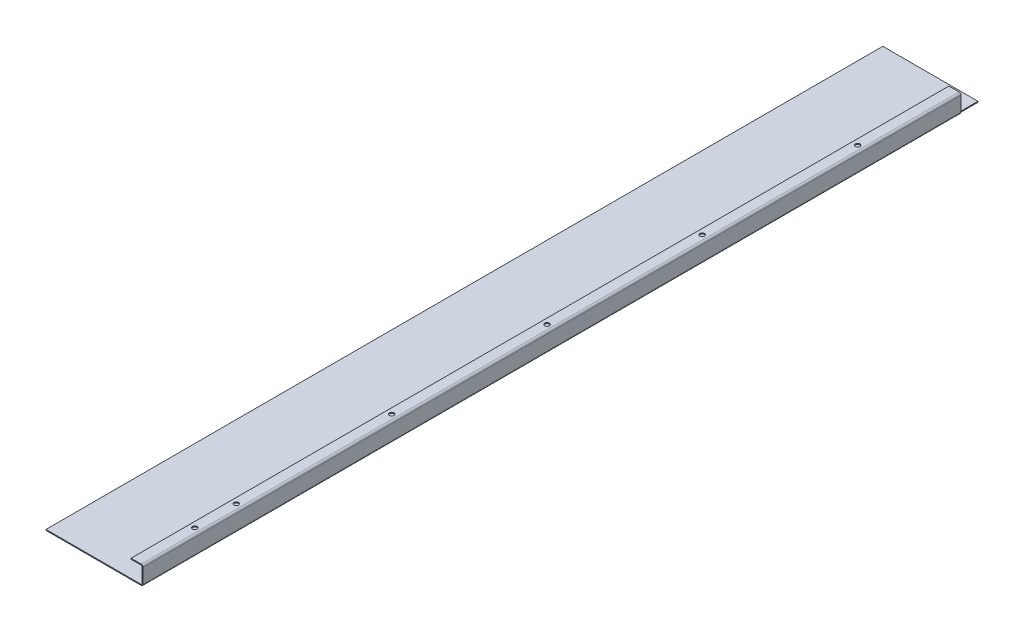
ISO-10303-21;
HEADER;
FILE_DESCRIPTION(('STEP AP214'),'2;1');
FILE_NAME('part.step','',(''),(''),'','','');
FILE_SCHEMA(('AUTOMOTIVE_DESIGN { 1 0 10303 214 1 1 1 1 }'));
ENDSEC;
DATA;
#1=APPLICATION_CONTEXT('core data for automotive mechanical design processes');
#2=APPLICATION_PROTOCOL_DEFINITION('international standard','automotive_design',2000,#1);
#3=PRODUCT_CONTEXT('',#1,'mechanical');
#4=PRODUCT('Part','Part','',(#3));
#5=PRODUCT_RELATED_PRODUCT_CATEGORY('part','',(#4));
#6=PRODUCT_DEFINITION_FORMATION('','',#4);
#7=PRODUCT_DEFINITION_CONTEXT('part definition',#1,'design');
#8=PRODUCT_DEFINITION('design','',#6,#7);
#9=PRODUCT_DEFINITION_SHAPE('','',#8);
#10=(LENGTH_UNIT() NAMED_UNIT(*) SI_UNIT(.MILLI.,.METRE.));
#11=(NAMED_UNIT(*) PLANE_ANGLE_UNIT() SI_UNIT($,.RADIAN.));
#12=(NAMED_UNIT(*) SI_UNIT($,.STERADIAN.) SOLID_ANGLE_UNIT());
#13=UNCERTAINTY_MEASURE_WITH_UNIT(LENGTH_MEASURE(1.E-05),#10,'distance_accuracy_value','');
#14=(GEOMETRIC_REPRESENTATION_CONTEXT(3) GLOBAL_UNCERTAINTY_ASSIGNED_CONTEXT((#13)) GLOBAL_UNIT_ASSIGNED_CONTEXT((#10,
#11,#12)) REPRESENTATION_CONTEXT('',''));
#15=CARTESIAN_POINT('',(0.,0.,0.));
#16=DIRECTION('',(0.,0.,1.));
#17=DIRECTION('',(1.,0.,0.));
#18=AXIS2_PLACEMENT_3D('',#15,#16,#17);
#19=CARTESIAN_POINT('',(105.,-3.86956670765295E-13,0.));
#20=DIRECTION('',(-1.,0.,0.));
#21=DIRECTION('',(0.,-1.,0.));
#22=AXIS2_PLACEMENT_3D('',#19,#20,#21);
#23=PLANE('',#22);
#24=DIRECTION('',(0.,-1.,0.));
#25=VECTOR('',#24,1.);
#26=CARTESIAN_POINT('',(105.,-3.83465189426452E-13,-884.7));
#27=LINE('',#26,#25);
#28=CARTESIAN_POINT('',(105.,17.,-884.7));
#29=VERTEX_POINT('',#28);
#30=CARTESIAN_POINT('',(105.,0.999999999999918,-884.7));
#31=VERTEX_POINT('',#30);
#32=EDGE_CURVE('E351',#29,#31,#27,.T.);
#33=ORIENTED_EDGE('',*,*,#32,.F.);
#34=DIRECTION('',(0.,0.,-1.));
#35=VECTOR('',#34,1.);
#36=CARTESIAN_POINT('',(105.,17.,-905.2));
#37=LINE('',#36,#35);
#38=CARTESIAN_POINT('',(105.,17.,0.));
#39=VERTEX_POINT('',#38);
#40=EDGE_CURVE('E216',#29,#39,#37,.F.);
#41=ORIENTED_EDGE('',*,*,#40,.T.);
#42=DIRECTION('',(0.,-1.,0.));
#43=VECTOR('',#42,1.);
#44=CARTESIAN_POINT('',(105.,-3.86956670765295E-13,0.));
#45=LINE('',#44,#43);
#46=CARTESIAN_POINT('',(105.,0.999999999999969,0.));
#47=VERTEX_POINT('',#46);
#48=EDGE_CURVE('E229',#39,#47,#45,.T.);
#49=ORIENTED_EDGE('',*,*,#48,.T.);
#50=DIRECTION('',(0.,0.,-1.));
#51=VECTOR('',#50,1.);
#52=CARTESIAN_POINT('',(105.,0.999999999999997,0.));
#53=LINE('',#52,#51);
#54=EDGE_CURVE('E235',#31,#47,#53,.F.);
#55=ORIENTED_EDGE('',*,*,#54,.F.);
#56=EDGE_LOOP('',(#33,#41,#49,#55));
#57=FACE_BOUND('',#56,.T.);
#58=ADVANCED_FACE('F78',(#57),#23,.F.);
#59=CARTESIAN_POINT('',(104.,-3.83465189426452E-13,0.));
#60=DIRECTION('',(-1.,0.,0.));
#61=DIRECTION('',(0.,-1.,0.));
#62=AXIS2_PLACEMENT_3D('',#59,#60,#61);
#63=PLANE('',#62);
#64=DIRECTION('',(0.,0.,-1.));
#65=VECTOR('',#64,1.);
#66=CARTESIAN_POINT('',(104.,17.,-905.2));
#67=LINE('',#66,#65);
#68=CARTESIAN_POINT('',(104.,17.,-884.7));
#69=VERTEX_POINT('',#68);
#70=CARTESIAN_POINT('',(104.,17.,0.));
#71=VERTEX_POINT('',#70);
#72=EDGE_CURVE('E223',#69,#71,#67,.F.);
#73=ORIENTED_EDGE('',*,*,#72,.F.);
#74=DIRECTION('',(0.,-1.,0.));
#75=VECTOR('',#74,1.);
#76=CARTESIAN_POINT('',(104.,-3.83304621342186E-13,-884.7));
#77=LINE('',#76,#75);
#78=CARTESIAN_POINT('',(104.,0.999999999999973,-884.7));
#79=VERTEX_POINT('',#78);
#80=EDGE_CURVE('E352',#69,#79,#77,.T.);
#81=ORIENTED_EDGE('',*,*,#80,.T.);
#82=DIRECTION('',(0.,0.,-1.));
#83=VECTOR('',#82,1.);
#84=CARTESIAN_POINT('',(104.,1.,0.));
#85=LINE('',#84,#83);
#86=CARTESIAN_POINT('',(104.,0.999999999999973,0.));
#87=VERTEX_POINT('',#86);
#88=EDGE_CURVE('E237',#87,#79,#85,.T.);
#89=ORIENTED_EDGE('',*,*,#88,.F.);
#90=DIRECTION('',(0.,1.,0.));
#91=VECTOR('',#90,1.);
#92=CARTESIAN_POINT('',(104.,0.,0.));
#93=LINE('',#92,#91);
#94=EDGE_CURVE('E233',#71,#87,#93,.F.);
#95=ORIENTED_EDGE('',*,*,#94,.F.);
#96=EDGE_LOOP('',(#73,#81,#89,#95));
#97=FACE_BOUND('',#96,.T.);
#98=ADVANCED_FACE('F399',(#97),#63,.T.);
#99=CARTESIAN_POINT('',(103.,0.999999999999977,-905.2));
#100=DIRECTION('',(0.,0.,-1.));
#101=DIRECTION('',(1.,0.,0.));
#102=AXIS2_PLACEMENT_3D('',#99,#100,#101);
#103=CYLINDRICAL_SURFACE('',#102,2.00000000000008);
#104=DIRECTION('',(0.,0.,-1.));
#105=VECTOR('',#104,1.);
#106=CARTESIAN_POINT('',(103.,-1.00000000000011,-905.2));
#107=LINE('',#106,#105);
#108=CARTESIAN_POINT('',(103.,-1.00000000000011,-884.7));
#109=VERTEX_POINT('',#108);
#110=CARTESIAN_POINT('',(103.,-1.,0.));
#111=VERTEX_POINT('',#110);
#112=EDGE_CURVE('E103',#109,#111,#107,.F.);
#113=ORIENTED_EDGE('',*,*,#112,.F.);
#114=CARTESIAN_POINT('',(103.,0.999999999999893,-884.7));
#115=DIRECTION('',(0.,0.,1.));
#116=DIRECTION('',(1.,0.,0.));
#117=AXIS2_PLACEMENT_3D('',#114,#115,#116);
#118=CIRCLE('',#117,2.);
#119=EDGE_CURVE('E323',#109,#31,#118,.T.);
#120=ORIENTED_EDGE('',*,*,#119,.T.);
#121=ORIENTED_EDGE('',*,*,#54,.T.);
#122=CARTESIAN_POINT('',(103.,0.999999999999977,0.));
#123=DIRECTION('',(0.,0.,-1.));
#124=DIRECTION('',(-1.,0.,0.));
#125=AXIS2_PLACEMENT_3D('',#122,#123,#124);
#126=CIRCLE('',#125,2.00000000000008);
#127=EDGE_CURVE('E244',#111,#47,#126,.F.);
#128=ORIENTED_EDGE('',*,*,#127,.F.);
#129=EDGE_LOOP('',(#113,#120,#121,#128));
#130=FACE_BOUND('',#129,.T.);
#131=ADVANCED_FACE('F405',(#130),#103,.T.);
#132=CARTESIAN_POINT('',(103.,0.999999999999977,-905.2));
#133=DIRECTION('',(0.,0.,-1.));
#134=DIRECTION('',(1.,0.,0.));
#135=AXIS2_PLACEMENT_3D('',#132,#133,#134);
#136=CYLINDRICAL_SURFACE('',#135,1.00000000000008);
#137=CARTESIAN_POINT('',(103.,0.999999999999893,-884.7));
#138=DIRECTION('',(0.,0.,1.));
#139=DIRECTION('',(1.,0.,0.));
#140=AXIS2_PLACEMENT_3D('',#137,#138,#139);
#141=CIRCLE('',#140,1.);
#142=CARTESIAN_POINT('',(103.,-1.07336015076065E-13,-884.7));
#143=VERTEX_POINT('',#142);
#144=EDGE_CURVE('E329',#143,#79,#141,.T.);
#145=ORIENTED_EDGE('',*,*,#144,.F.);
#146=DIRECTION('',(0.,0.,-1.));
#147=VECTOR('',#146,1.);
#148=CARTESIAN_POINT('',(103.,-1.07336015076065E-13,-905.2));
#149=LINE('',#148,#147);
#150=CARTESIAN_POINT('',(103.,-1.07336015076065E-13,0.));
#151=VERTEX_POINT('',#150);
#152=EDGE_CURVE('E232',#143,#151,#149,.F.);
#153=ORIENTED_EDGE('',*,*,#152,.T.);
#154=CARTESIAN_POINT('',(103.,0.999999999999977,0.));
#155=DIRECTION('',(0.,0.,-1.));
#156=DIRECTION('',(-1.,0.,0.));
#157=AXIS2_PLACEMENT_3D('',#154,#155,#156);
#158=CIRCLE('',#157,1.00000000000008);
#159=EDGE_CURVE('E248',#151,#87,#158,.F.);
#160=ORIENTED_EDGE('',*,*,#159,.T.);
#161=ORIENTED_EDGE('',*,*,#88,.T.);
#162=EDGE_LOOP('',(#145,#153,#160,#161));
#163=FACE_BOUND('',#162,.T.);
#164=ADVANCED_FACE('F420',(#163),#136,.F.);
#165=CARTESIAN_POINT('',(103.,17.,-905.2));
#166=DIRECTION('',(0.,0.,-1.));
#167=DIRECTION('',(0.,1.,0.));
#168=AXIS2_PLACEMENT_3D('',#165,#166,#167);
#169=CYLINDRICAL_SURFACE('',#168,2.);
#170=ORIENTED_EDGE('',*,*,#40,.F.);
#171=CARTESIAN_POINT('',(103.,17.,-884.7));
#172=DIRECTION('',(0.,0.,1.));
#173=DIRECTION('',(1.,0.,0.));
#174=AXIS2_PLACEMENT_3D('',#171,#172,#173);
#175=CIRCLE('',#174,2.);
#176=CARTESIAN_POINT('',(103.,19.0000000000001,-884.7));
#177=VERTEX_POINT('',#176);
#178=EDGE_CURVE('E182',#29,#177,#175,.T.);
#179=ORIENTED_EDGE('',*,*,#178,.T.);
#180=DIRECTION('',(0.,0.,-1.));
#181=VECTOR('',#180,1.);
#182=CARTESIAN_POINT('',(103.,19.,0.));
#183=LINE('',#182,#181);
#184=CARTESIAN_POINT('',(103.,19.,0.));
#185=VERTEX_POINT('',#184);
#186=EDGE_CURVE('E208',#177,#185,#183,.F.);
#187=ORIENTED_EDGE('',*,*,#186,.T.);
#188=CARTESIAN_POINT('',(103.,17.,0.));
#189=DIRECTION('',(0.,0.,-1.));
#190=DIRECTION('',(-1.,0.,0.));
#191=AXIS2_PLACEMENT_3D('',#188,#189,#190);
#192=CIRCLE('',#191,2.);
#193=EDGE_CURVE('E218',#39,#185,#192,.F.);
#194=ORIENTED_EDGE('',*,*,#193,.F.);
#195=EDGE_LOOP('',(#170,#179,#187,#194));
#196=FACE_BOUND('',#195,.T.);
#197=ADVANCED_FACE('F424',(#196),#169,.T.);
#198=CARTESIAN_POINT('',(103.,17.,-905.2));
#199=DIRECTION('',(0.,0.,-1.));
#200=DIRECTION('',(0.,1.,0.));
#201=AXIS2_PLACEMENT_3D('',#198,#199,#200);
#202=CYLINDRICAL_SURFACE('',#201,1.);
#203=CARTESIAN_POINT('',(103.,17.,-884.7));
#204=DIRECTION('',(0.,0.,1.));
#205=DIRECTION('',(1.,0.,0.));
#206=AXIS2_PLACEMENT_3D('',#203,#204,#205);
#207=CIRCLE('',#206,1.);
#208=CARTESIAN_POINT('',(103.,18.,-884.7));
#209=VERTEX_POINT('',#208);
#210=EDGE_CURVE('E183',#69,#209,#207,.T.);
#211=ORIENTED_EDGE('',*,*,#210,.F.);
#212=ORIENTED_EDGE('',*,*,#72,.T.);
#213=CARTESIAN_POINT('',(103.,17.,0.));
#214=DIRECTION('',(0.,0.,-1.));
#215=DIRECTION('',(-1.,0.,0.));
#216=AXIS2_PLACEMENT_3D('',#213,#214,#215);
#217=CIRCLE('',#216,1.);
#218=CARTESIAN_POINT('',(103.,18.,0.));
#219=VERTEX_POINT('',#218);
#220=EDGE_CURVE('E207',#71,#219,#217,.F.);
#221=ORIENTED_EDGE('',*,*,#220,.T.);
#222=DIRECTION('',(0.,0.,-1.));
#223=VECTOR('',#222,1.);
#224=CARTESIAN_POINT('',(103.,18.,0.));
#225=LINE('',#224,#223);
#226=EDGE_CURVE('E199',#219,#209,#225,.T.);
#227=ORIENTED_EDGE('',*,*,#226,.T.);
#228=EDGE_LOOP('',(#211,#212,#221,#227));
#229=FACE_BOUND('',#228,.T.);
#230=ADVANCED_FACE('F205',(#229),#202,.F.);
#231=CARTESIAN_POINT('',(1.40823756520346E-13,19.0000000000008,0.));
#232=DIRECTION('',(0.,-1.,0.));
#233=DIRECTION('',(1.,0.,0.));
#234=AXIS2_PLACEMENT_3D('',#231,#232,#233);
#235=PLANE('',#234);
#236=CARTESIAN_POINT('',(97.9999999999785,19.,-780.));
#237=DIRECTION('',(0.,1.,0.));
#238=DIRECTION('',(-1.,0.,0.));
#239=AXIS2_PLACEMENT_3D('',#236,#237,#238);
#240=CIRCLE('',#239,2.5);
#241=CARTESIAN_POINT('',(95.4999999999785,19.0000000000001,-780.));
#242=VERTEX_POINT('',#241);
#243=EDGE_CURVE('E320',#242,#242,#240,.T.);
#244=ORIENTED_EDGE('',*,*,#243,.F.);
#245=EDGE_LOOP('',(#244));
#246=FACE_BOUND('',#245,.T.);
#247=CARTESIAN_POINT('',(97.9999999999838,19.,-612.));
#248=DIRECTION('',(0.,1.,0.));
#249=DIRECTION('',(-1.,0.,0.));
#250=AXIS2_PLACEMENT_3D('',#247,#248,#249);
#251=CIRCLE('',#250,2.5);
#252=CARTESIAN_POINT('',(95.4999999999838,19.0000000000001,-612.));
#253=VERTEX_POINT('',#252);
#254=EDGE_CURVE('E322',#253,#253,#251,.T.);
#255=ORIENTED_EDGE('',*,*,#254,.F.);
#256=EDGE_LOOP('',(#255));
#257=FACE_BOUND('',#256,.T.);
#258=CARTESIAN_POINT('',(97.9999999999892,19.,-444.));
#259=DIRECTION('',(0.,1.,0.));
#260=DIRECTION('',(-1.,0.,0.));
#261=AXIS2_PLACEMENT_3D('',#258,#259,#260);
#262=CIRCLE('',#261,2.5);
#263=CARTESIAN_POINT('',(95.4999999999892,19.0000000000001,-444.));
#264=VERTEX_POINT('',#263);
#265=EDGE_CURVE('E326',#264,#264,#262,.T.);
#266=ORIENTED_EDGE('',*,*,#265,.F.);
#267=EDGE_LOOP('',(#266));
#268=FACE_BOUND('',#267,.T.);
#269=CARTESIAN_POINT('',(97.9999999999945,19.,-276.));
#270=DIRECTION('',(0.,1.,0.));
#271=DIRECTION('',(-1.,0.,0.));
#272=AXIS2_PLACEMENT_3D('',#269,#270,#271);
#273=CIRCLE('',#272,2.50000000000001);
#274=CARTESIAN_POINT('',(95.4999999999945,19.0000000000001,-276.));
#275=VERTEX_POINT('',#274);
#276=EDGE_CURVE('E370',#275,#275,#273,.T.);
#277=ORIENTED_EDGE('',*,*,#276,.F.);
#278=EDGE_LOOP('',(#277));
#279=FACE_BOUND('',#278,.T.);
#280=CARTESIAN_POINT('',(97.9999999999999,19.,-108.));
#281=DIRECTION('',(0.,1.,0.));
#282=DIRECTION('',(-1.,0.,0.));
#283=AXIS2_PLACEMENT_3D('',#280,#281,#282);
#284=CIRCLE('',#283,2.50000000000001);
#285=CARTESIAN_POINT('',(95.4999999999999,19.0000000000001,-108.));
#286=VERTEX_POINT('',#285);
#287=EDGE_CURVE('E367',#286,#286,#284,.T.);
#288=ORIENTED_EDGE('',*,*,#287,.F.);
#289=EDGE_LOOP('',(#288));
#290=FACE_BOUND('',#289,.T.);
#291=CARTESIAN_POINT('',(97.9999999999999,19.,-63.));
#292=DIRECTION('',(0.,1.,0.));
#293=DIRECTION('',(-1.,0.,0.));
#294=AXIS2_PLACEMENT_3D('',#291,#292,#293);
#295=CIRCLE('',#294,2.5);
#296=CARTESIAN_POINT('',(95.4999999999999,19.0000000000001,-63.));
#297=VERTEX_POINT('',#296);
#298=EDGE_CURVE('E280',#297,#297,#295,.T.);
#299=ORIENTED_EDGE('',*,*,#298,.F.);
#300=EDGE_LOOP('',(#299));
#301=FACE_BOUND('',#300,.T.);
#302=DIRECTION('',(1.,0.,0.));
#303=VECTOR('',#302,1.);
#304=CARTESIAN_POINT('',(-3.19189119579733E-13,19.0000000000003,-884.7));
#305=LINE('',#304,#303);
#306=CARTESIAN_POINT('',(91.9999999999999,19.0000000000001,-884.7));
#307=VERTEX_POINT('',#306);
#308=EDGE_CURVE('E179',#307,#177,#305,.T.);
#309=ORIENTED_EDGE('',*,*,#308,.F.);
#310=DIRECTION('',(0.,0.,1.));
#311=VECTOR('',#310,1.);
#312=CARTESIAN_POINT('',(92.0000000000001,19.0000000000001,0.));
#313=LINE('',#312,#311);
#314=CARTESIAN_POINT('',(92.0000000000001,19.0000000000001,0.));
#315=VERTEX_POINT('',#314);
#316=EDGE_CURVE('E338',#307,#315,#313,.T.);
#317=ORIENTED_EDGE('',*,*,#316,.T.);
#318=DIRECTION('',(1.,0.,0.));
#319=VECTOR('',#318,1.);
#320=CARTESIAN_POINT('',(1.40823756520346E-13,19.0000000000008,0.));
#321=LINE('',#320,#319);
#322=EDGE_CURVE('E335',#315,#185,#321,.T.);
#323=ORIENTED_EDGE('',*,*,#322,.T.);
#324=ORIENTED_EDGE('',*,*,#186,.F.);
#325=EDGE_LOOP('',(#309,#317,#323,#324));
#326=FACE_BOUND('',#325,.T.);
#327=ADVANCED_FACE('F301',(#246,#257,#268,#279,#290,#301,#326),#235,.F.);
#328=CARTESIAN_POINT('',(1.33680225758394E-13,18.0000000000008,0.));
#329=DIRECTION('',(0.,-1.,0.));
#330=DIRECTION('',(1.,0.,0.));
#331=AXIS2_PLACEMENT_3D('',#328,#329,#330);
#332=PLANE('',#331);
#333=CARTESIAN_POINT('',(97.9999999999999,18.,-63.));
#334=DIRECTION('',(0.,-1.,0.));
#335=DIRECTION('',(1.,0.,0.));
#336=AXIS2_PLACEMENT_3D('',#333,#334,#335);
#337=CIRCLE('',#336,2.5);
#338=CARTESIAN_POINT('',(100.5,18.,-63.));
#339=VERTEX_POINT('',#338);
#340=EDGE_CURVE('E82',#339,#339,#337,.T.);
#341=ORIENTED_EDGE('',*,*,#340,.F.);
#342=EDGE_LOOP('',(#341));
#343=FACE_BOUND('',#342,.T.);
#344=CARTESIAN_POINT('',(97.9999999999999,18.,-108.));
#345=DIRECTION('',(0.,-1.,0.));
#346=DIRECTION('',(1.,0.,0.));
#347=AXIS2_PLACEMENT_3D('',#344,#345,#346);
#348=CIRCLE('',#347,2.50000000000001);
#349=CARTESIAN_POINT('',(100.5,18.,-108.));
#350=VERTEX_POINT('',#349);
#351=EDGE_CURVE('E288',#350,#350,#348,.T.);
#352=ORIENTED_EDGE('',*,*,#351,.F.);
#353=EDGE_LOOP('',(#352));
#354=FACE_BOUND('',#353,.T.);
#355=CARTESIAN_POINT('',(97.9999999999945,18.,-276.));
#356=DIRECTION('',(0.,-1.,0.));
#357=DIRECTION('',(1.,0.,0.));
#358=AXIS2_PLACEMENT_3D('',#355,#356,#357);
#359=CIRCLE('',#358,2.50000000000001);
#360=CARTESIAN_POINT('',(100.499999999995,18.,-276.));
#361=VERTEX_POINT('',#360);
#362=EDGE_CURVE('E286',#361,#361,#359,.T.);
#363=ORIENTED_EDGE('',*,*,#362,.F.);
#364=EDGE_LOOP('',(#363));
#365=FACE_BOUND('',#364,.T.);
#366=CARTESIAN_POINT('',(97.9999999999892,18.,-444.));
#367=DIRECTION('',(0.,-1.,0.));
#368=DIRECTION('',(1.,0.,0.));
#369=AXIS2_PLACEMENT_3D('',#366,#367,#368);
#370=CIRCLE('',#369,2.5);
#371=CARTESIAN_POINT('',(100.499999999989,18.,-444.));
#372=VERTEX_POINT('',#371);
#373=EDGE_CURVE('E283',#372,#372,#370,.T.);
#374=ORIENTED_EDGE('',*,*,#373,.F.);
#375=EDGE_LOOP('',(#374));
#376=FACE_BOUND('',#375,.T.);
#377=CARTESIAN_POINT('',(97.9999999999838,18.,-612.));
#378=DIRECTION('',(0.,-1.,0.));
#379=DIRECTION('',(1.,0.,0.));
#380=AXIS2_PLACEMENT_3D('',#377,#378,#379);
#381=CIRCLE('',#380,2.5);
#382=CARTESIAN_POINT('',(100.499999999984,18.,-612.));
#383=VERTEX_POINT('',#382);
#384=EDGE_CURVE('E279',#383,#383,#381,.T.);
#385=ORIENTED_EDGE('',*,*,#384,.F.);
#386=EDGE_LOOP('',(#385));
#387=FACE_BOUND('',#386,.T.);
#388=CARTESIAN_POINT('',(97.9999999999785,18.,-780.));
#389=DIRECTION('',(0.,-1.,0.));
#390=DIRECTION('',(1.,0.,0.));
#391=AXIS2_PLACEMENT_3D('',#388,#389,#390);
#392=CIRCLE('',#391,2.5);
#393=CARTESIAN_POINT('',(100.499999999978,18.,-780.));
#394=VERTEX_POINT('',#393);
#395=EDGE_CURVE('E276',#394,#394,#392,.T.);
#396=ORIENTED_EDGE('',*,*,#395,.F.);
#397=EDGE_LOOP('',(#396));
#398=FACE_BOUND('',#397,.T.);
#399=DIRECTION('',(0.,0.,-1.));
#400=VECTOR('',#399,1.);
#401=CARTESIAN_POINT('',(92.0000000000001,18.0000000000001,0.));
#402=LINE('',#401,#400);
#403=CARTESIAN_POINT('',(91.9999999999999,18.0000000000001,-884.7));
#404=VERTEX_POINT('',#403);
#405=CARTESIAN_POINT('',(92.0000000000001,18.0000000000001,0.));
#406=VERTEX_POINT('',#405);
#407=EDGE_CURVE('E201',#404,#406,#402,.F.);
#408=ORIENTED_EDGE('',*,*,#407,.F.);
#409=DIRECTION('',(1.,0.,0.));
#410=VECTOR('',#409,1.);
#411=CARTESIAN_POINT('',(1.33595742037109E-13,18.0000000000008,-884.7));
#412=LINE('',#411,#410);
#413=EDGE_CURVE('E95',#404,#209,#412,.T.);
#414=ORIENTED_EDGE('',*,*,#413,.T.);
#415=ORIENTED_EDGE('',*,*,#226,.F.);
#416=DIRECTION('',(-1.,0.,0.));
#417=VECTOR('',#416,1.);
#418=CARTESIAN_POINT('',(104.,18.,0.));
#419=LINE('',#418,#417);
#420=EDGE_CURVE('E340',#406,#219,#419,.F.);
#421=ORIENTED_EDGE('',*,*,#420,.F.);
#422=EDGE_LOOP('',(#408,#414,#415,#421));
#423=FACE_BOUND('',#422,.T.);
#424=ADVANCED_FACE('F197',(#343,#354,#365,#376,#387,#398,#423),#332,.T.);
#425=CARTESIAN_POINT('',(92.0000000000001,19.0000000000001,0.));
#426=DIRECTION('',(1.,0.,0.));
#427=DIRECTION('',(0.,1.,0.));
#428=AXIS2_PLACEMENT_3D('',#425,#426,#427);
#429=PLANE('',#428);
#430=DIRECTION('',(0.,1.,0.));
#431=VECTOR('',#430,1.);
#432=CARTESIAN_POINT('',(91.9999999999999,19.0000000000001,-884.7));
#433=LINE('',#432,#431);
#434=EDGE_CURVE('E202',#307,#404,#433,.F.);
#435=ORIENTED_EDGE('',*,*,#434,.T.);
#436=ORIENTED_EDGE('',*,*,#407,.T.);
#437=DIRECTION('',(0.,-1.,0.));
#438=VECTOR('',#437,1.);
#439=CARTESIAN_POINT('',(92.0000000000001,19.0000000000001,0.));
#440=LINE('',#439,#438);
#441=EDGE_CURVE('E225',#315,#406,#440,.T.);
#442=ORIENTED_EDGE('',*,*,#441,.F.);
#443=ORIENTED_EDGE('',*,*,#316,.F.);
#444=EDGE_LOOP('',(#435,#436,#442,#443));
#445=FACE_BOUND('',#444,.T.);
#446=ADVANCED_FACE('F300',(#445),#429,.F.);
#447=CARTESIAN_POINT('',(105.,0.,0.));
#448=DIRECTION('',(0.,0.,-1.));
#449=DIRECTION('',(0.,1.,0.));
#450=AXIS2_PLACEMENT_3D('',#447,#448,#449);
#451=PLANE('',#450);
#452=DIRECTION('',(1.,0.,0.));
#453=VECTOR('',#452,1.);
#454=CARTESIAN_POINT('',(104.,17.,0.));
#455=LINE('',#454,#453);
#456=EDGE_CURVE('E221',#71,#39,#455,.T.);
#457=ORIENTED_EDGE('',*,*,#456,.F.);
#458=ORIENTED_EDGE('',*,*,#94,.T.);
#459=DIRECTION('',(-1.,0.,0.));
#460=VECTOR('',#459,1.);
#461=CARTESIAN_POINT('',(105.,0.999999999999997,0.));
#462=LINE('',#461,#460);
#463=EDGE_CURVE('E228',#87,#47,#462,.F.);
#464=ORIENTED_EDGE('',*,*,#463,.T.);
#465=ORIENTED_EDGE('',*,*,#48,.F.);
#466=EDGE_LOOP('',(#457,#458,#464,#465));
#467=FACE_BOUND('',#466,.T.);
#468=ADVANCED_FACE('F413',(#467),#451,.F.);
#469=CARTESIAN_POINT('',(-1.66533453693773E-13,-1.,-905.2));
#470=DIRECTION('',(0.,0.,-1.));
#471=DIRECTION('',(-1.,0.,0.));
#472=AXIS2_PLACEMENT_3D('',#469,#470,#471);
#473=PLANE('',#472);
#474=DIRECTION('',(-1.,0.,0.));
#475=VECTOR('',#474,1.);
#476=CARTESIAN_POINT('',(-1.66533453693773E-13,0.,-905.2));
#477=LINE('',#476,#475);
#478=CARTESIAN_POINT('',(103.,-1.07336015076065E-13,-905.2));
#479=VERTEX_POINT('',#478);
#480=CARTESIAN_POINT('',(-1.66533453693773E-13,0.,-905.2));
#481=VERTEX_POINT('',#480);
#482=EDGE_CURVE('E264',#479,#481,#477,.T.);
#483=ORIENTED_EDGE('',*,*,#482,.F.);
#484=DIRECTION('',(0.,-1.,0.));
#485=VECTOR('',#484,1.);
#486=CARTESIAN_POINT('',(103.,-1.07336015076065E-13,-905.2));
#487=LINE('',#486,#485);
#488=CARTESIAN_POINT('',(103.,-1.00000000000011,-905.2));
#489=VERTEX_POINT('',#488);
#490=EDGE_CURVE('E247',#479,#489,#487,.T.);
#491=ORIENTED_EDGE('',*,*,#490,.T.);
#492=DIRECTION('',(-1.,0.,0.));
#493=VECTOR('',#492,1.);
#494=CARTESIAN_POINT('',(-1.66533453693773E-13,-1.,-905.2));
#495=LINE('',#494,#493);
#496=CARTESIAN_POINT('',(-1.66533453693773E-13,-1.,-905.2));
#497=VERTEX_POINT('',#496);
#498=EDGE_CURVE('E267',#489,#497,#495,.T.);
#499=ORIENTED_EDGE('',*,*,#498,.T.);
#500=DIRECTION('',(0.,1.,0.));
#501=VECTOR('',#500,1.);
#502=CARTESIAN_POINT('',(-1.66533453693773E-13,-1.,-905.2));
#503=LINE('',#502,#501);
#504=EDGE_CURVE('E13',#497,#481,#503,.T.);
#505=ORIENTED_EDGE('',*,*,#504,.T.);
#506=EDGE_LOOP('',(#483,#491,#499,#505));
#507=FACE_BOUND('',#506,.T.);
#508=ADVANCED_FACE('F416',(#507),#473,.T.);
#509=CARTESIAN_POINT('',(0.,-1.,0.));
#510=DIRECTION('',(0.,-1.,0.));
#511=DIRECTION('',(0.,0.,-1.));
#512=AXIS2_PLACEMENT_3D('',#509,#510,#511);
#513=PLANE('',#512);
#514=ORIENTED_EDGE('',*,*,#498,.F.);
#515=EDGE_CURVE('E242',#489,#109,#107,.F.);
#516=ORIENTED_EDGE('',*,*,#515,.T.);
#517=ORIENTED_EDGE('',*,*,#112,.T.);
#518=DIRECTION('',(1.,0.,0.));
#519=VECTOR('',#518,1.);
#520=CARTESIAN_POINT('',(0.,-1.,0.));
#521=LINE('',#520,#519);
#522=CARTESIAN_POINT('',(0.,-1.,0.));
#523=VERTEX_POINT('',#522);
#524=EDGE_CURVE('E263',#523,#111,#521,.T.);
#525=ORIENTED_EDGE('',*,*,#524,.F.);
#526=DIRECTION('',(0.,0.,1.));
#527=VECTOR('',#526,1.);
#528=CARTESIAN_POINT('',(0.,-1.,0.));
#529=LINE('',#528,#527);
#530=EDGE_CURVE('E260',#497,#523,#529,.T.);
#531=ORIENTED_EDGE('',*,*,#530,.F.);
#532=EDGE_LOOP('',(#514,#516,#517,#525,#531));
#533=FACE_BOUND('',#532,.T.);
#534=ADVANCED_FACE('F431',(#533),#513,.T.);
#535=CARTESIAN_POINT('',(0.,0.,0.));
#536=DIRECTION('',(0.,-1.,0.));
#537=DIRECTION('',(0.,0.,-1.));
#538=AXIS2_PLACEMENT_3D('',#535,#536,#537);
#539=PLANE('',#538);
#540=EDGE_CURVE('E251',#479,#143,#149,.F.);
#541=ORIENTED_EDGE('',*,*,#540,.F.);
#542=ORIENTED_EDGE('',*,*,#482,.T.);
#543=DIRECTION('',(0.,0.,1.));
#544=VECTOR('',#543,1.);
#545=CARTESIAN_POINT('',(0.,0.,0.));
#546=LINE('',#545,#544);
#547=CARTESIAN_POINT('',(0.,0.,0.));
#548=VERTEX_POINT('',#547);
#549=EDGE_CURVE('E257',#481,#548,#546,.T.);
#550=ORIENTED_EDGE('',*,*,#549,.T.);
#551=DIRECTION('',(1.,0.,0.));
#552=VECTOR('',#551,1.);
#553=CARTESIAN_POINT('',(0.,0.,0.));
#554=LINE('',#553,#552);
#555=EDGE_CURVE('E271',#548,#151,#554,.T.);
#556=ORIENTED_EDGE('',*,*,#555,.T.);
#557=ORIENTED_EDGE('',*,*,#152,.F.);
#558=EDGE_LOOP('',(#541,#542,#550,#556,#557));
#559=FACE_BOUND('',#558,.T.);
#560=ADVANCED_FACE('F434',(#559),#539,.F.);
#561=CARTESIAN_POINT('',(0.,-1.,0.));
#562=DIRECTION('',(-1.,0.,0.));
#563=DIRECTION('',(0.,0.,1.));
#564=AXIS2_PLACEMENT_3D('',#561,#562,#563);
#565=PLANE('',#564);
#566=ORIENTED_EDGE('',*,*,#549,.F.);
#567=ORIENTED_EDGE('',*,*,#504,.F.);
#568=ORIENTED_EDGE('',*,*,#530,.T.);
#569=DIRECTION('',(0.,1.,0.));
#570=VECTOR('',#569,1.);
#571=CARTESIAN_POINT('',(0.,-1.,0.));
#572=LINE('',#571,#570);
#573=EDGE_CURVE('E87',#523,#548,#572,.T.);
#574=ORIENTED_EDGE('',*,*,#573,.T.);
#575=EDGE_LOOP('',(#566,#567,#568,#574));
#576=FACE_BOUND('',#575,.T.);
#577=ADVANCED_FACE('F80',(#576),#565,.T.);
#578=CARTESIAN_POINT('',(0.,-1.,0.));
#579=DIRECTION('',(0.,0.,1.));
#580=DIRECTION('',(1.,0.,0.));
#581=AXIS2_PLACEMENT_3D('',#578,#579,#580);
#582=PLANE('',#581);
#583=DIRECTION('',(0.,-1.,0.));
#584=VECTOR('',#583,1.);
#585=CARTESIAN_POINT('',(103.,-1.07336015076065E-13,0.));
#586=LINE('',#585,#584);
#587=EDGE_CURVE('E254',#151,#111,#586,.T.);
#588=ORIENTED_EDGE('',*,*,#587,.F.);
#589=ORIENTED_EDGE('',*,*,#555,.F.);
#590=ORIENTED_EDGE('',*,*,#573,.F.);
#591=ORIENTED_EDGE('',*,*,#524,.T.);
#592=EDGE_LOOP('',(#588,#589,#590,#591));
#593=FACE_BOUND('',#592,.T.);
#594=ADVANCED_FACE('F429',(#593),#582,.T.);
#595=CARTESIAN_POINT('',(103.,0.999999999999977,0.));
#596=DIRECTION('',(0.,0.,1.));
#597=DIRECTION('',(1.,0.,0.));
#598=AXIS2_PLACEMENT_3D('',#595,#596,#597);
#599=PLANE('',#598);
#600=ORIENTED_EDGE('',*,*,#463,.F.);
#601=ORIENTED_EDGE('',*,*,#159,.F.);
#602=ORIENTED_EDGE('',*,*,#587,.T.);
#603=ORIENTED_EDGE('',*,*,#127,.T.);
#604=EDGE_LOOP('',(#600,#601,#602,#603));
#605=FACE_BOUND('',#604,.T.);
#606=ADVANCED_FACE('F426',(#605),#599,.T.);
#607=CARTESIAN_POINT('',(103.,17.,0.));
#608=DIRECTION('',(0.,0.,1.));
#609=DIRECTION('',(1.,0.,0.));
#610=AXIS2_PLACEMENT_3D('',#607,#608,#609);
#611=PLANE('',#610);
#612=DIRECTION('',(0.,-1.,0.));
#613=VECTOR('',#612,1.);
#614=CARTESIAN_POINT('',(103.,19.,0.));
#615=LINE('',#614,#613);
#616=EDGE_CURVE('E209',#219,#185,#615,.F.);
#617=ORIENTED_EDGE('',*,*,#616,.F.);
#618=ORIENTED_EDGE('',*,*,#220,.F.);
#619=ORIENTED_EDGE('',*,*,#456,.T.);
#620=ORIENTED_EDGE('',*,*,#193,.T.);
#621=EDGE_LOOP('',(#617,#618,#619,#620));
#622=FACE_BOUND('',#621,.T.);
#623=ADVANCED_FACE('F410',(#622),#611,.T.);
#624=CARTESIAN_POINT('',(104.,19.,0.));
#625=DIRECTION('',(0.,0.,-1.));
#626=DIRECTION('',(-1.,0.,0.));
#627=AXIS2_PLACEMENT_3D('',#624,#625,#626);
#628=PLANE('',#627);
#629=ORIENTED_EDGE('',*,*,#616,.T.);
#630=ORIENTED_EDGE('',*,*,#322,.F.);
#631=ORIENTED_EDGE('',*,*,#441,.T.);
#632=ORIENTED_EDGE('',*,*,#420,.T.);
#633=EDGE_LOOP('',(#629,#630,#631,#632));
#634=FACE_BOUND('',#633,.T.);
#635=ADVANCED_FACE('F316',(#634),#628,.F.);
#636=CARTESIAN_POINT('',(97.9999999999784,9.00000000000004,-780.));
#637=DIRECTION('',(0.,1.,0.));
#638=DIRECTION('',(-1.,0.,0.));
#639=AXIS2_PLACEMENT_3D('',#636,#637,#638);
#640=CYLINDRICAL_SURFACE('',#639,2.5);
#641=ORIENTED_EDGE('',*,*,#395,.T.);
#642=EDGE_LOOP('',(#641));
#643=FACE_BOUND('',#642,.T.);
#644=ORIENTED_EDGE('',*,*,#243,.T.);
#645=EDGE_LOOP('',(#644));
#646=FACE_BOUND('',#645,.T.);
#647=ADVANCED_FACE('F312',(#643,#646),#640,.F.);
#648=CARTESIAN_POINT('',(97.9999999999838,9.00000000000004,-612.));
#649=DIRECTION('',(0.,1.,0.));
#650=DIRECTION('',(-1.,0.,0.));
#651=AXIS2_PLACEMENT_3D('',#648,#649,#650);
#652=CYLINDRICAL_SURFACE('',#651,2.5);
#653=ORIENTED_EDGE('',*,*,#384,.T.);
#654=EDGE_LOOP('',(#653));
#655=FACE_BOUND('',#654,.T.);
#656=ORIENTED_EDGE('',*,*,#254,.T.);
#657=EDGE_LOOP('',(#656));
#658=FACE_BOUND('',#657,.T.);
#659=ADVANCED_FACE('F315',(#655,#658),#652,.F.);
#660=CARTESIAN_POINT('',(97.9999999999891,9.00000000000004,-444.));
#661=DIRECTION('',(0.,1.,0.));
#662=DIRECTION('',(-1.,0.,0.));
#663=AXIS2_PLACEMENT_3D('',#660,#661,#662);
#664=CYLINDRICAL_SURFACE('',#663,2.5);
#665=ORIENTED_EDGE('',*,*,#373,.T.);
#666=EDGE_LOOP('',(#665));
#667=FACE_BOUND('',#666,.T.);
#668=ORIENTED_EDGE('',*,*,#265,.T.);
#669=EDGE_LOOP('',(#668));
#670=FACE_BOUND('',#669,.T.);
#671=ADVANCED_FACE('F375',(#667,#670),#664,.F.);
#672=CARTESIAN_POINT('',(97.9999999999945,9.00000000000004,-276.));
#673=DIRECTION('',(0.,1.,0.));
#674=DIRECTION('',(-1.,0.,0.));
#675=AXIS2_PLACEMENT_3D('',#672,#673,#674);
#676=CYLINDRICAL_SURFACE('',#675,2.50000000000001);
#677=ORIENTED_EDGE('',*,*,#362,.T.);
#678=EDGE_LOOP('',(#677));
#679=FACE_BOUND('',#678,.T.);
#680=ORIENTED_EDGE('',*,*,#276,.T.);
#681=EDGE_LOOP('',(#680));
#682=FACE_BOUND('',#681,.T.);
#683=ADVANCED_FACE('F396',(#679,#682),#676,.F.);
#684=CARTESIAN_POINT('',(97.9999999999998,9.00000000000004,-108.));
#685=DIRECTION('',(0.,1.,0.));
#686=DIRECTION('',(-1.,0.,0.));
#687=AXIS2_PLACEMENT_3D('',#684,#685,#686);
#688=CYLINDRICAL_SURFACE('',#687,2.50000000000001);
#689=ORIENTED_EDGE('',*,*,#351,.T.);
#690=EDGE_LOOP('',(#689));
#691=FACE_BOUND('',#690,.T.);
#692=ORIENTED_EDGE('',*,*,#287,.T.);
#693=EDGE_LOOP('',(#692));
#694=FACE_BOUND('',#693,.T.);
#695=ADVANCED_FACE('F387',(#691,#694),#688,.F.);
#696=CARTESIAN_POINT('',(97.9999999999999,9.00000000000004,-63.));
#697=DIRECTION('',(0.,1.,0.));
#698=DIRECTION('',(-1.,0.,0.));
#699=AXIS2_PLACEMENT_3D('',#696,#697,#698);
#700=CYLINDRICAL_SURFACE('',#699,2.5);
#701=ORIENTED_EDGE('',*,*,#340,.T.);
#702=EDGE_LOOP('',(#701));
#703=FACE_BOUND('',#702,.T.);
#704=ORIENTED_EDGE('',*,*,#298,.T.);
#705=EDGE_LOOP('',(#704));
#706=FACE_BOUND('',#705,.T.);
#707=ADVANCED_FACE('F295',(#703,#706),#700,.F.);
#708=CARTESIAN_POINT('',(103.,0.999999999999893,-884.7));
#709=DIRECTION('',(0.,0.,-1.));
#710=DIRECTION('',(-1.,0.,0.));
#711=AXIS2_PLACEMENT_3D('',#708,#709,#710);
#712=PLANE('',#711);
#713=DIRECTION('',(0.,-1.,0.));
#714=VECTOR('',#713,1.);
#715=CARTESIAN_POINT('',(103.,-3.76161090580234E-13,-884.7));
#716=LINE('',#715,#714);
#717=EDGE_CURVE('E361',#143,#109,#716,.T.);
#718=ORIENTED_EDGE('',*,*,#717,.F.);
#719=ORIENTED_EDGE('',*,*,#144,.T.);
#720=DIRECTION('',(-1.,0.,0.));
#721=VECTOR('',#720,1.);
#722=CARTESIAN_POINT('',(105.,0.999999999999918,-884.7));
#723=LINE('',#722,#721);
#724=EDGE_CURVE('E359',#31,#79,#723,.T.);
#725=ORIENTED_EDGE('',*,*,#724,.F.);
#726=ORIENTED_EDGE('',*,*,#119,.F.);
#727=EDGE_LOOP('',(#718,#719,#725,#726));
#728=FACE_BOUND('',#727,.T.);
#729=ADVANCED_FACE('F386',(#728),#712,.T.);
#730=CARTESIAN_POINT('',(103.,-1.07336015076065E-13,-894.95));
#731=DIRECTION('',(-1.,0.,0.));
#732=DIRECTION('',(0.,0.,-1.));
#733=AXIS2_PLACEMENT_3D('',#730,#731,#732);
#734=PLANE('',#733);
#735=ORIENTED_EDGE('',*,*,#490,.F.);
#736=ORIENTED_EDGE('',*,*,#540,.T.);
#737=ORIENTED_EDGE('',*,*,#717,.T.);
#738=ORIENTED_EDGE('',*,*,#515,.F.);
#739=EDGE_LOOP('',(#735,#736,#737,#738));
#740=FACE_BOUND('',#739,.T.);
#741=ADVANCED_FACE('F393',(#740),#734,.F.);
#742=CARTESIAN_POINT('',(103.,17.,-884.7));
#743=DIRECTION('',(0.,0.,-1.));
#744=DIRECTION('',(-1.,0.,0.));
#745=AXIS2_PLACEMENT_3D('',#742,#743,#744);
#746=PLANE('',#745);
#747=ORIENTED_EDGE('',*,*,#210,.T.);
#748=DIRECTION('',(0.,-1.,0.));
#749=VECTOR('',#748,1.);
#750=CARTESIAN_POINT('',(103.,19.0000000000001,-884.7));
#751=LINE('',#750,#749);
#752=EDGE_CURVE('E175',#177,#209,#751,.T.);
#753=ORIENTED_EDGE('',*,*,#752,.F.);
#754=ORIENTED_EDGE('',*,*,#178,.F.);
#755=DIRECTION('',(-1.,0.,0.));
#756=VECTOR('',#755,1.);
#757=CARTESIAN_POINT('',(105.,17.,-884.7));
#758=LINE('',#757,#756);
#759=EDGE_CURVE('E189',#29,#69,#758,.T.);
#760=ORIENTED_EDGE('',*,*,#759,.T.);
#761=EDGE_LOOP('',(#747,#753,#754,#760));
#762=FACE_BOUND('',#761,.T.);
#763=ADVANCED_FACE('F187',(#762),#746,.T.);
#764=CARTESIAN_POINT('',(105.,-3.83465189426452E-13,-884.7));
#765=DIRECTION('',(0.,0.,-1.));
#766=DIRECTION('',(0.,-1.,0.));
#767=AXIS2_PLACEMENT_3D('',#764,#765,#766);
#768=PLANE('',#767);
#769=ORIENTED_EDGE('',*,*,#759,.F.);
#770=ORIENTED_EDGE('',*,*,#32,.T.);
#771=ORIENTED_EDGE('',*,*,#724,.T.);
#772=ORIENTED_EDGE('',*,*,#80,.F.);
#773=EDGE_LOOP('',(#769,#770,#771,#772));
#774=FACE_BOUND('',#773,.T.);
#775=ADVANCED_FACE('F470',(#774),#768,.T.);
#776=CARTESIAN_POINT('',(-3.19189119579733E-13,19.0000000000003,-884.7));
#777=DIRECTION('',(0.,0.,-1.));
#778=DIRECTION('',(1.,0.,0.));
#779=AXIS2_PLACEMENT_3D('',#776,#777,#778);
#780=PLANE('',#779);
#781=ORIENTED_EDGE('',*,*,#434,.F.);
#782=ORIENTED_EDGE('',*,*,#308,.T.);
#783=ORIENTED_EDGE('',*,*,#752,.T.);
#784=ORIENTED_EDGE('',*,*,#413,.F.);
#785=EDGE_LOOP('',(#781,#782,#783,#784));
#786=FACE_BOUND('',#785,.T.);
#787=ADVANCED_FACE('F177',(#786),#780,.T.);
#788=CLOSED_SHELL('',(#58,#98,#131,#164,#197,#230,#327,#424,#446,#468,#508,#534,#560,#577,#594,
#606,#623,#635,#647,#659,#671,#683,#695,#707,#729,#741,#763,#775,#787));
#789=MANIFOLD_SOLID_BREP('B2',#788);
#790=ADVANCED_BREP_SHAPE_REPRESENTATION('',(#18,#789),#14);
#791=SHAPE_DEFINITION_REPRESENTATION(#9,#790);
ENDSEC;
END-ISO-10303-21;
